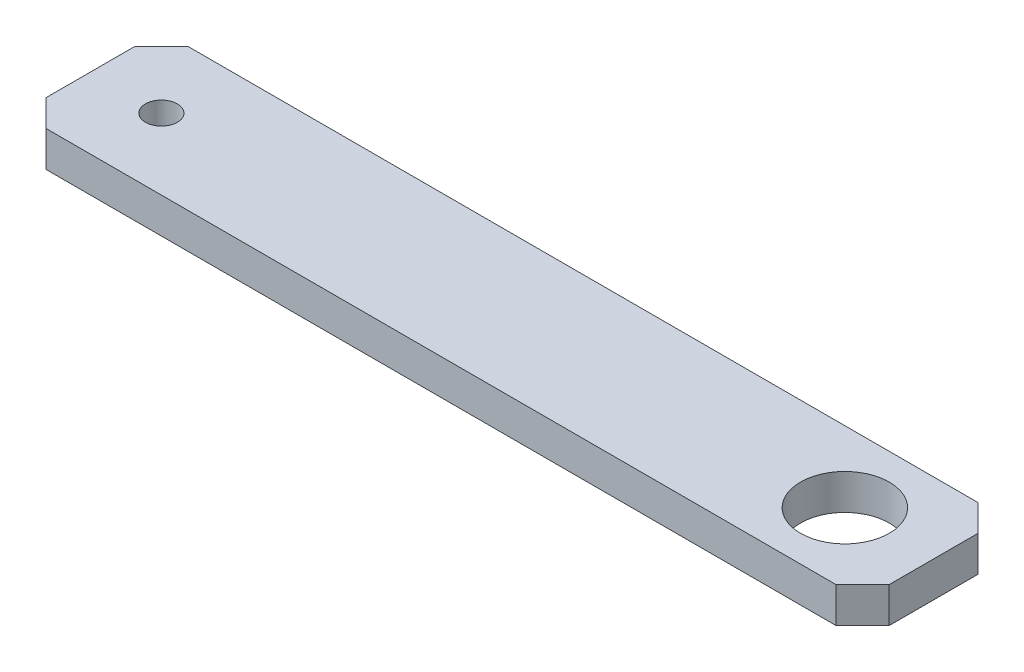
ISO-10303-21;
HEADER;
FILE_DESCRIPTION(('STEP AP214'),'2;1');
FILE_NAME('part.step','',(''),(''),'','','');
FILE_SCHEMA(('AUTOMOTIVE_DESIGN { 1 0 10303 214 1 1 1 1 }'));
ENDSEC;
DATA;
#1=APPLICATION_CONTEXT('core data for automotive mechanical design processes');
#2=APPLICATION_PROTOCOL_DEFINITION('international standard','automotive_design',2000,#1);
#3=PRODUCT_CONTEXT('',#1,'mechanical');
#4=PRODUCT('Part','Part','',(#3));
#5=PRODUCT_RELATED_PRODUCT_CATEGORY('part','',(#4));
#6=PRODUCT_DEFINITION_FORMATION('','',#4);
#7=PRODUCT_DEFINITION_CONTEXT('part definition',#1,'design');
#8=PRODUCT_DEFINITION('design','',#6,#7);
#9=PRODUCT_DEFINITION_SHAPE('','',#8);
#10=(LENGTH_UNIT() NAMED_UNIT(*) SI_UNIT(.MILLI.,.METRE.));
#11=(NAMED_UNIT(*) PLANE_ANGLE_UNIT() SI_UNIT($,.RADIAN.));
#12=(NAMED_UNIT(*) SI_UNIT($,.STERADIAN.) SOLID_ANGLE_UNIT());
#13=UNCERTAINTY_MEASURE_WITH_UNIT(LENGTH_MEASURE(1.E-05),#10,'distance_accuracy_value','');
#14=(GEOMETRIC_REPRESENTATION_CONTEXT(3) GLOBAL_UNCERTAINTY_ASSIGNED_CONTEXT((#13)) GLOBAL_UNIT_ASSIGNED_CONTEXT((#10,
#11,#12)) REPRESENTATION_CONTEXT('',''));
#15=CARTESIAN_POINT('',(0.,0.,0.));
#16=DIRECTION('',(0.,0.,1.));
#17=DIRECTION('',(1.,0.,0.));
#18=AXIS2_PLACEMENT_3D('',#15,#16,#17);
#19=CARTESIAN_POINT('',(475.000000000001,9.9999999999989,-40.0000000000002));
#20=DIRECTION('',(0.,0.,1.));
#21=DIRECTION('',(1.,0.,0.));
#22=AXIS2_PLACEMENT_3D('',#19,#20,#21);
#23=PLANE('',#22);
#24=DIRECTION('',(-1.,0.,0.));
#25=VECTOR('',#24,1.);
#26=CARTESIAN_POINT('',(475.000000000001,9.9999999999989,-40.0000000000002));
#27=LINE('',#26,#25);
#28=CARTESIAN_POINT('',(460.000000000001,9.99999999999968,-40.0000000000003));
#29=VERTEX_POINT('',#28);
#30=CARTESIAN_POINT('',(14.9999999999997,9.99999999999834,-40.0000000000003));
#31=VERTEX_POINT('',#30);
#32=EDGE_CURVE('E136',#29,#31,#27,.T.);
#33=ORIENTED_EDGE('',*,*,#32,.F.);
#34=DIRECTION('',(0.,-1.,0.));
#35=VECTOR('',#34,1.);
#36=CARTESIAN_POINT('',(460.000000000001,9.99999999999968,-40.0000000000003));
#37=LINE('',#36,#35);
#38=CARTESIAN_POINT('',(459.999999999999,-10.0000000000003,-39.9999999999999));
#39=VERTEX_POINT('',#38);
#40=EDGE_CURVE('E53',#29,#39,#37,.T.);
#41=ORIENTED_EDGE('',*,*,#40,.T.);
#42=DIRECTION('',(-1.,0.,0.));
#43=VECTOR('',#42,1.);
#44=CARTESIAN_POINT('',(475.000000000001,-10.0000000000011,-40.0000000000001));
#45=LINE('',#44,#43);
#46=CARTESIAN_POINT('',(15.0000000000001,-10.0000000000017,-40.0000000000001));
#47=VERTEX_POINT('',#46);
#48=EDGE_CURVE('E120',#39,#47,#45,.T.);
#49=ORIENTED_EDGE('',*,*,#48,.T.);
#50=DIRECTION('',(0.,1.,0.));
#51=VECTOR('',#50,1.);
#52=CARTESIAN_POINT('',(14.9999999999995,9.99999999999834,-40.0000000000001));
#53=LINE('',#52,#51);
#54=EDGE_CURVE('E148',#47,#31,#53,.T.);
#55=ORIENTED_EDGE('',*,*,#54,.T.);
#56=EDGE_LOOP('',(#33,#41,#49,#55));
#57=FACE_BOUND('',#56,.T.);
#58=ADVANCED_FACE('F44',(#57),#23,.F.);
#59=CARTESIAN_POINT('',(475.000000000001,9.9999999999989,-40.0000000000002));
#60=DIRECTION('',(0.,-1.,0.));
#61=DIRECTION('',(0.,0.,-1.));
#62=AXIS2_PLACEMENT_3D('',#59,#60,#61);
#63=PLANE('',#62);
#64=CARTESIAN_POINT('',(425.000000000001,10.,0.));
#65=DIRECTION('',(0.,1.,0.));
#66=DIRECTION('',(0.,0.,1.));
#67=AXIS2_PLACEMENT_3D('',#64,#65,#66);
#68=CIRCLE('',#67,25.);
#69=CARTESIAN_POINT('',(425.000000000001,10.,25.));
#70=VERTEX_POINT('',#69);
#71=EDGE_CURVE('E220',#70,#70,#68,.T.);
#72=ORIENTED_EDGE('',*,*,#71,.F.);
#73=EDGE_LOOP('',(#72));
#74=FACE_BOUND('',#73,.T.);
#75=CARTESIAN_POINT('',(39.9999999999996,10.,0.));
#76=DIRECTION('',(0.,1.,0.));
#77=DIRECTION('',(0.,0.,1.));
#78=AXIS2_PLACEMENT_3D('',#75,#76,#77);
#79=CIRCLE('',#78,9.);
#80=CARTESIAN_POINT('',(39.9999999999996,10.,9.00000000000004));
#81=VERTEX_POINT('',#80);
#82=EDGE_CURVE('E210',#81,#81,#79,.T.);
#83=ORIENTED_EDGE('',*,*,#82,.F.);
#84=EDGE_LOOP('',(#83));
#85=FACE_BOUND('',#84,.T.);
#86=DIRECTION('',(0.,0.,1.));
#87=VECTOR('',#86,1.);
#88=CARTESIAN_POINT('',(475.000000000001,9.9999999999989,-40.0000000000002));
#89=LINE('',#88,#87);
#90=CARTESIAN_POINT('',(475.000000000001,9.9999999999989,-25.0000000000002));
#91=VERTEX_POINT('',#90);
#92=CARTESIAN_POINT('',(475.,9.99999999999856,24.9999999999998));
#93=VERTEX_POINT('',#92);
#94=EDGE_CURVE('E184',#91,#93,#89,.T.);
#95=ORIENTED_EDGE('',*,*,#94,.F.);
#96=DIRECTION('',(0.70710678118655,0.,0.707106781186548));
#97=VECTOR('',#96,1.);
#98=CARTESIAN_POINT('',(475.000000000001,9.9999999999989,-25.0000000000002));
#99=LINE('',#98,#97);
#100=EDGE_CURVE('E67',#91,#29,#99,.F.);
#101=ORIENTED_EDGE('',*,*,#100,.T.);
#102=ORIENTED_EDGE('',*,*,#32,.T.);
#103=DIRECTION('',(-0.707106781186547,0.,0.70710678118655));
#104=VECTOR('',#103,1.);
#105=CARTESIAN_POINT('',(14.9999999999995,9.99999999999834,-40.0000000000001));
#106=LINE('',#105,#104);
#107=CARTESIAN_POINT('',(-3.33066907387547E-13,10.,-25.0000000000002));
#108=VERTEX_POINT('',#107);
#109=EDGE_CURVE('E152',#31,#108,#106,.T.);
#110=ORIENTED_EDGE('',*,*,#109,.T.);
#111=DIRECTION('',(0.,0.,1.));
#112=VECTOR('',#111,1.);
#113=CARTESIAN_POINT('',(-1.2490009027033E-13,10.0000000000005,-40.0000000000001));
#114=LINE('',#113,#112);
#115=CARTESIAN_POINT('',(-3.46944695195361E-13,10.,24.9999999999999));
#116=VERTEX_POINT('',#115);
#117=EDGE_CURVE('E196',#108,#116,#114,.T.);
#118=ORIENTED_EDGE('',*,*,#117,.T.);
#119=DIRECTION('',(0.707106781186549,0.,0.707106781186548));
#120=VECTOR('',#119,1.);
#121=CARTESIAN_POINT('',(14.9999999999997,9.99999999999845,40.0000000000001));
#122=LINE('',#121,#120);
#123=CARTESIAN_POINT('',(14.9999999999997,9.99999999999845,40.0000000000001));
#124=VERTEX_POINT('',#123);
#125=EDGE_CURVE('E145',#116,#124,#122,.T.);
#126=ORIENTED_EDGE('',*,*,#125,.T.);
#127=DIRECTION('',(-1.,0.,0.));
#128=VECTOR('',#127,1.);
#129=CARTESIAN_POINT('',(475.000000000001,9.99999999999856,39.9999999999999));
#130=LINE('',#129,#128);
#131=CARTESIAN_POINT('',(460.000000000001,9.9999999999999,39.9999999999996));
#132=VERTEX_POINT('',#131);
#133=EDGE_CURVE('E119',#132,#124,#130,.T.);
#134=ORIENTED_EDGE('',*,*,#133,.F.);
#135=DIRECTION('',(-0.70710678118655,0.,0.707106781186548));
#136=VECTOR('',#135,1.);
#137=CARTESIAN_POINT('',(475.000000000001,9.99999999999856,25.));
#138=LINE('',#137,#136);
#139=EDGE_CURVE('E171',#132,#93,#138,.F.);
#140=ORIENTED_EDGE('',*,*,#139,.T.);
#141=EDGE_LOOP('',(#95,#101,#102,#110,#118,#126,#134,#140));
#142=FACE_BOUND('',#141,.T.);
#143=ADVANCED_FACE('F229',(#74,#85,#142),#63,.F.);
#144=CARTESIAN_POINT('',(475.,-10.0000000000015,40.0000000000005));
#145=DIRECTION('',(0.,0.,-1.));
#146=DIRECTION('',(-1.,0.,0.));
#147=AXIS2_PLACEMENT_3D('',#144,#145,#146);
#148=PLANE('',#147);
#149=DIRECTION('',(-1.,0.,0.));
#150=VECTOR('',#149,1.);
#151=CARTESIAN_POINT('',(475.,-10.0000000000015,40.0000000000005));
#152=LINE('',#151,#150);
#153=CARTESIAN_POINT('',(459.999999999999,-10.0000000000001,40.));
#154=VERTEX_POINT('',#153);
#155=CARTESIAN_POINT('',(15.0000000000002,-10.0000000000013,40.0000000000001));
#156=VERTEX_POINT('',#155);
#157=EDGE_CURVE('E107',#154,#156,#152,.T.);
#158=ORIENTED_EDGE('',*,*,#157,.F.);
#159=DIRECTION('',(0.,1.,0.));
#160=VECTOR('',#159,1.);
#161=CARTESIAN_POINT('',(459.999999999999,-10.0000000000001,40.));
#162=LINE('',#161,#160);
#163=EDGE_CURVE('E168',#154,#132,#162,.T.);
#164=ORIENTED_EDGE('',*,*,#163,.T.);
#165=ORIENTED_EDGE('',*,*,#133,.T.);
#166=DIRECTION('',(0.,-1.,0.));
#167=VECTOR('',#166,1.);
#168=CARTESIAN_POINT('',(14.9999999999998,-10.0000000000013,40.0000000000002));
#169=LINE('',#168,#167);
#170=EDGE_CURVE('E127',#124,#156,#169,.T.);
#171=ORIENTED_EDGE('',*,*,#170,.T.);
#172=EDGE_LOOP('',(#158,#164,#165,#171));
#173=FACE_BOUND('',#172,.T.);
#174=ADVANCED_FACE('F132',(#173),#148,.F.);
#175=CARTESIAN_POINT('',(475.000000000001,-10.0000000000011,-40.0000000000001));
#176=DIRECTION('',(0.,1.,0.));
#177=DIRECTION('',(0.,0.,1.));
#178=AXIS2_PLACEMENT_3D('',#175,#176,#177);
#179=PLANE('',#178);
#180=CARTESIAN_POINT('',(425.,-10.,-2.77555756156289E-13));
#181=DIRECTION('',(0.,1.,0.));
#182=DIRECTION('',(0.,0.,1.));
#183=AXIS2_PLACEMENT_3D('',#180,#181,#182);
#184=CIRCLE('',#183,25.);
#185=CARTESIAN_POINT('',(425.,-10.,24.9999999999997));
#186=VERTEX_POINT('',#185);
#187=EDGE_CURVE('E215',#186,#186,#184,.T.);
#188=ORIENTED_EDGE('',*,*,#187,.T.);
#189=EDGE_LOOP('',(#188));
#190=FACE_BOUND('',#189,.T.);
#191=CARTESIAN_POINT('',(40.,-10.,0.));
#192=DIRECTION('',(0.,1.,0.));
#193=DIRECTION('',(0.,0.,1.));
#194=AXIS2_PLACEMENT_3D('',#191,#192,#193);
#195=CIRCLE('',#194,9.);
#196=CARTESIAN_POINT('',(40.,-10.,9.00000000000001));
#197=VERTEX_POINT('',#196);
#198=EDGE_CURVE('E200',#197,#197,#195,.T.);
#199=ORIENTED_EDGE('',*,*,#198,.T.);
#200=EDGE_LOOP('',(#199));
#201=FACE_BOUND('',#200,.T.);
#202=ORIENTED_EDGE('',*,*,#48,.F.);
#203=DIRECTION('',(-0.70710678118655,0.,-0.707106781186548));
#204=VECTOR('',#203,1.);
#205=CARTESIAN_POINT('',(475.,-10.0000000000011,-25.0000000000001));
#206=LINE('',#205,#204);
#207=CARTESIAN_POINT('',(475.,-10.0000000000011,-25.0000000000001));
#208=VERTEX_POINT('',#207);
#209=EDGE_CURVE('E11',#39,#208,#206,.F.);
#210=ORIENTED_EDGE('',*,*,#209,.T.);
#211=DIRECTION('',(0.,0.,-1.));
#212=VECTOR('',#211,1.);
#213=CARTESIAN_POINT('',(475.000000000001,-10.0000000000011,-40.0000000000001));
#214=LINE('',#213,#212);
#215=CARTESIAN_POINT('',(475.,-10.0000000000015,25.0000000000006));
#216=VERTEX_POINT('',#215);
#217=EDGE_CURVE('E187',#216,#208,#214,.T.);
#218=ORIENTED_EDGE('',*,*,#217,.F.);
#219=DIRECTION('',(0.70710678118655,0.,-0.707106781186548));
#220=VECTOR('',#219,1.);
#221=CARTESIAN_POINT('',(475.,-10.0000000000015,25.0000000000006));
#222=LINE('',#221,#220);
#223=EDGE_CURVE('E114',#216,#154,#222,.F.);
#224=ORIENTED_EDGE('',*,*,#223,.T.);
#225=ORIENTED_EDGE('',*,*,#157,.T.);
#226=DIRECTION('',(-0.707106781186549,0.,-0.707106781186548));
#227=VECTOR('',#226,1.);
#228=CARTESIAN_POINT('',(14.9999999999998,-10.0000000000013,40.0000000000002));
#229=LINE('',#228,#227);
#230=CARTESIAN_POINT('',(-3.33066907387547E-13,-10.,25.0000000000001));
#231=VERTEX_POINT('',#230);
#232=EDGE_CURVE('E111',#156,#231,#229,.T.);
#233=ORIENTED_EDGE('',*,*,#232,.T.);
#234=DIRECTION('',(0.,0.,-1.));
#235=VECTOR('',#234,1.);
#236=CARTESIAN_POINT('',(0.,-9.99999999999956,-40.0000000000003));
#237=LINE('',#236,#235);
#238=CARTESIAN_POINT('',(-2.4980018054066E-13,-10.,-25.0000000000004));
#239=VERTEX_POINT('',#238);
#240=EDGE_CURVE('E188',#231,#239,#237,.T.);
#241=ORIENTED_EDGE('',*,*,#240,.T.);
#242=DIRECTION('',(0.707106781186547,0.,-0.70710678118655));
#243=VECTOR('',#242,1.);
#244=CARTESIAN_POINT('',(14.9999999999998,-10.0000000000017,-40.0000000000003));
#245=LINE('',#244,#243);
#246=EDGE_CURVE('E158',#239,#47,#245,.T.);
#247=ORIENTED_EDGE('',*,*,#246,.T.);
#248=EDGE_LOOP('',(#202,#210,#218,#224,#225,#233,#241,#247));
#249=FACE_BOUND('',#248,.T.);
#250=ADVANCED_FACE('F109',(#190,#201,#249),#179,.F.);
#251=CARTESIAN_POINT('',(475.,4.44089209850063E-13,-3.88578058618805E-13));
#252=DIRECTION('',(-1.,0.,0.));
#253=DIRECTION('',(0.,0.,1.));
#254=AXIS2_PLACEMENT_3D('',#251,#252,#253);
#255=PLANE('',#254);
#256=ORIENTED_EDGE('',*,*,#217,.T.);
#257=DIRECTION('',(0.,1.,0.));
#258=VECTOR('',#257,1.);
#259=CARTESIAN_POINT('',(475.000000000001,-1.11022302462516E-12,-25.0000000000003));
#260=LINE('',#259,#258);
#261=EDGE_CURVE('E175',#208,#91,#260,.T.);
#262=ORIENTED_EDGE('',*,*,#261,.T.);
#263=ORIENTED_EDGE('',*,*,#94,.T.);
#264=DIRECTION('',(0.,-1.,0.));
#265=VECTOR('',#264,1.);
#266=CARTESIAN_POINT('',(475.,-1.4432899320127E-12,25.0000000000004));
#267=LINE('',#266,#265);
#268=EDGE_CURVE('E162',#93,#216,#267,.T.);
#269=ORIENTED_EDGE('',*,*,#268,.T.);
#270=EDGE_LOOP('',(#256,#262,#263,#269));
#271=FACE_BOUND('',#270,.T.);
#272=ADVANCED_FACE('F237',(#271),#255,.F.);
#273=CARTESIAN_POINT('',(0.,0.,0.));
#274=DIRECTION('',(-1.,0.,0.));
#275=DIRECTION('',(0.,0.,1.));
#276=AXIS2_PLACEMENT_3D('',#273,#274,#275);
#277=PLANE('',#276);
#278=ORIENTED_EDGE('',*,*,#117,.F.);
#279=DIRECTION('',(0.,-1.,0.));
#280=VECTOR('',#279,1.);
#281=CARTESIAN_POINT('',(-2.4980018054066E-13,-10.,-25.0000000000004));
#282=LINE('',#281,#280);
#283=EDGE_CURVE('E155',#108,#239,#282,.T.);
#284=ORIENTED_EDGE('',*,*,#283,.T.);
#285=ORIENTED_EDGE('',*,*,#240,.F.);
#286=DIRECTION('',(0.,1.,0.));
#287=VECTOR('',#286,1.);
#288=CARTESIAN_POINT('',(-3.46944695195361E-13,10.,24.9999999999999));
#289=LINE('',#288,#287);
#290=EDGE_CURVE('E129',#231,#116,#289,.T.);
#291=ORIENTED_EDGE('',*,*,#290,.T.);
#292=EDGE_LOOP('',(#278,#284,#285,#291));
#293=FACE_BOUND('',#292,.T.);
#294=ADVANCED_FACE('F249',(#293),#277,.T.);
#295=CARTESIAN_POINT('',(39.9999999999996,10.,0.));
#296=DIRECTION('',(0.,1.,0.));
#297=DIRECTION('',(0.,0.,1.));
#298=AXIS2_PLACEMENT_3D('',#295,#296,#297);
#299=CYLINDRICAL_SURFACE('',#298,9.);
#300=ORIENTED_EDGE('',*,*,#198,.F.);
#301=EDGE_LOOP('',(#300));
#302=FACE_BOUND('',#301,.T.);
#303=ORIENTED_EDGE('',*,*,#82,.T.);
#304=EDGE_LOOP('',(#303));
#305=FACE_BOUND('',#304,.T.);
#306=ADVANCED_FACE('F268',(#302,#305),#299,.F.);
#307=CARTESIAN_POINT('',(425.000000000001,10.,0.));
#308=DIRECTION('',(0.,1.,0.));
#309=DIRECTION('',(0.,0.,1.));
#310=AXIS2_PLACEMENT_3D('',#307,#308,#309);
#311=CYLINDRICAL_SURFACE('',#310,25.);
#312=ORIENTED_EDGE('',*,*,#187,.F.);
#313=EDGE_LOOP('',(#312));
#314=FACE_BOUND('',#313,.T.);
#315=ORIENTED_EDGE('',*,*,#71,.T.);
#316=EDGE_LOOP('',(#315));
#317=FACE_BOUND('',#316,.T.);
#318=ADVANCED_FACE('F227',(#314,#317),#311,.F.);
#319=CARTESIAN_POINT('',(14.9999999999998,-10.0000000000013,40.0000000000002));
#320=DIRECTION('',(-0.707106781186548,0.,0.707106781186549));
#321=DIRECTION('',(0.,1.,0.));
#322=AXIS2_PLACEMENT_3D('',#319,#320,#321);
#323=PLANE('',#322);
#324=ORIENTED_EDGE('',*,*,#125,.F.);
#325=ORIENTED_EDGE('',*,*,#290,.F.);
#326=ORIENTED_EDGE('',*,*,#232,.F.);
#327=ORIENTED_EDGE('',*,*,#170,.F.);
#328=EDGE_LOOP('',(#324,#325,#326,#327));
#329=FACE_BOUND('',#328,.T.);
#330=ADVANCED_FACE('F126',(#329),#323,.T.);
#331=CARTESIAN_POINT('',(14.9999999999995,9.99999999999834,-40.0000000000001));
#332=DIRECTION('',(-0.70710678118655,0.,-0.707106781186547));
#333=DIRECTION('',(0.,-1.,0.));
#334=AXIS2_PLACEMENT_3D('',#331,#332,#333);
#335=PLANE('',#334);
#336=ORIENTED_EDGE('',*,*,#246,.F.);
#337=ORIENTED_EDGE('',*,*,#283,.F.);
#338=ORIENTED_EDGE('',*,*,#109,.F.);
#339=ORIENTED_EDGE('',*,*,#54,.F.);
#340=EDGE_LOOP('',(#336,#337,#338,#339));
#341=FACE_BOUND('',#340,.T.);
#342=ADVANCED_FACE('F245',(#341),#335,.T.);
#343=CARTESIAN_POINT('',(475.,-1.4432899320127E-12,25.0000000000004));
#344=DIRECTION('',(-0.707106781186548,0.,-0.70710678118655));
#345=DIRECTION('',(0.,-1.,0.));
#346=AXIS2_PLACEMENT_3D('',#343,#344,#345);
#347=PLANE('',#346);
#348=ORIENTED_EDGE('',*,*,#139,.F.);
#349=ORIENTED_EDGE('',*,*,#163,.F.);
#350=ORIENTED_EDGE('',*,*,#223,.F.);
#351=ORIENTED_EDGE('',*,*,#268,.F.);
#352=EDGE_LOOP('',(#348,#349,#350,#351));
#353=FACE_BOUND('',#352,.T.);
#354=ADVANCED_FACE('F251',(#353),#347,.F.);
#355=CARTESIAN_POINT('',(475.000000000001,-1.11022302462516E-12,-25.0000000000003));
#356=DIRECTION('',(-0.707106781186548,0.,0.70710678118655));
#357=DIRECTION('',(0.,1.,0.));
#358=AXIS2_PLACEMENT_3D('',#355,#356,#357);
#359=PLANE('',#358);
#360=ORIENTED_EDGE('',*,*,#209,.F.);
#361=ORIENTED_EDGE('',*,*,#40,.F.);
#362=ORIENTED_EDGE('',*,*,#100,.F.);
#363=ORIENTED_EDGE('',*,*,#261,.F.);
#364=EDGE_LOOP('',(#360,#361,#362,#363));
#365=FACE_BOUND('',#364,.T.);
#366=ADVANCED_FACE('F46',(#365),#359,.F.);
#367=CLOSED_SHELL('',(#58,#143,#174,#250,#272,#294,#306,#318,#330,#342,#354,#366));
#368=MANIFOLD_SOLID_BREP('B2',#367);
#369=ADVANCED_BREP_SHAPE_REPRESENTATION('',(#18,#368),#14);
#370=SHAPE_DEFINITION_REPRESENTATION(#9,#369);
ENDSEC;
END-ISO-10303-21;
